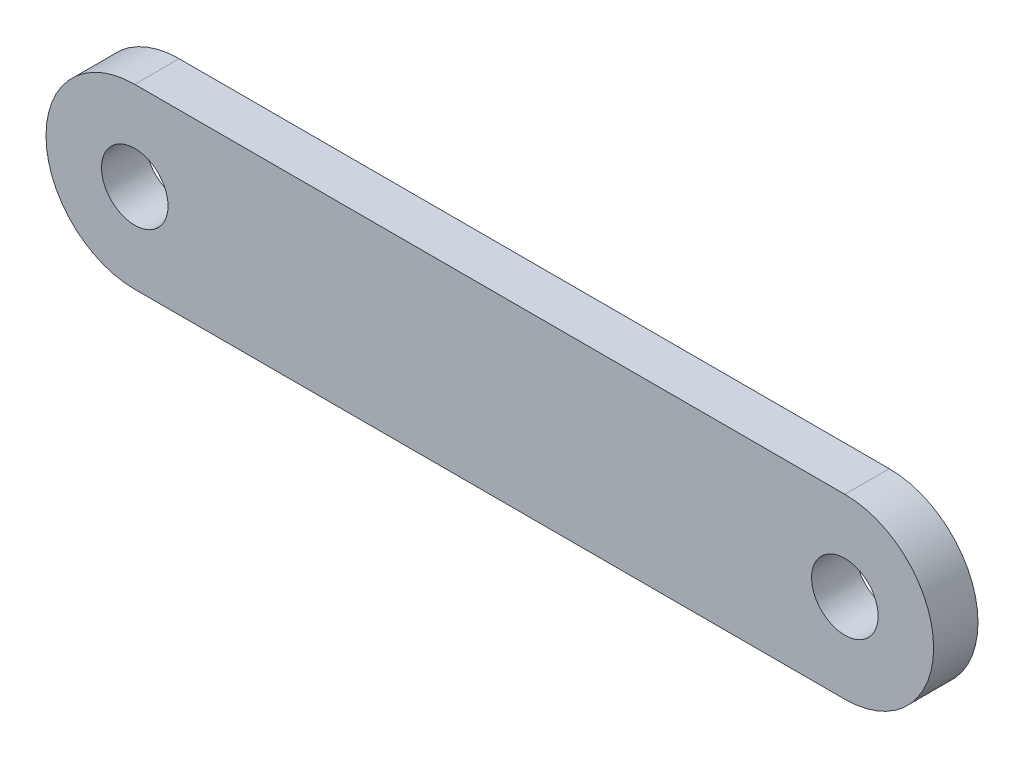
ISO-10303-21;
HEADER;
FILE_DESCRIPTION(('STEP AP214'),'2;1');
FILE_NAME('part.step','',(''),(''),'','','');
FILE_SCHEMA(('AUTOMOTIVE_DESIGN { 1 0 10303 214 1 1 1 1 }'));
ENDSEC;
DATA;
#1=APPLICATION_CONTEXT('core data for automotive mechanical design processes');
#2=APPLICATION_PROTOCOL_DEFINITION('international standard','automotive_design',2000,#1);
#3=PRODUCT_CONTEXT('',#1,'mechanical');
#4=PRODUCT('Part','Part','',(#3));
#5=PRODUCT_RELATED_PRODUCT_CATEGORY('part','',(#4));
#6=PRODUCT_DEFINITION_FORMATION('','',#4);
#7=PRODUCT_DEFINITION_CONTEXT('part definition',#1,'design');
#8=PRODUCT_DEFINITION('design','',#6,#7);
#9=PRODUCT_DEFINITION_SHAPE('','',#8);
#10=(LENGTH_UNIT() NAMED_UNIT(*) SI_UNIT(.MILLI.,.METRE.));
#11=(NAMED_UNIT(*) PLANE_ANGLE_UNIT() SI_UNIT($,.RADIAN.));
#12=(NAMED_UNIT(*) SI_UNIT($,.STERADIAN.) SOLID_ANGLE_UNIT());
#13=UNCERTAINTY_MEASURE_WITH_UNIT(LENGTH_MEASURE(1.E-05),#10,'distance_accuracy_value','');
#14=(GEOMETRIC_REPRESENTATION_CONTEXT(3) GLOBAL_UNCERTAINTY_ASSIGNED_CONTEXT((#13)) GLOBAL_UNIT_ASSIGNED_CONTEXT((#10,
#11,#12)) REPRESENTATION_CONTEXT('',''));
#15=CARTESIAN_POINT('',(0.,0.,0.));
#16=DIRECTION('',(0.,0.,1.));
#17=DIRECTION('',(1.,0.,0.));
#18=AXIS2_PLACEMENT_3D('',#15,#16,#17);
#19=CARTESIAN_POINT('',(-50.8,0.,6.35));
#20=DIRECTION('',(0.,0.,1.));
#21=DIRECTION('',(1.,0.,0.));
#22=AXIS2_PLACEMENT_3D('',#19,#20,#21);
#23=PLANE('',#22);
#24=CARTESIAN_POINT('',(50.8,0.,6.35));
#25=DIRECTION('',(0.,0.,1.));
#26=DIRECTION('',(1.,0.,0.));
#27=AXIS2_PLACEMENT_3D('',#24,#25,#26);
#28=CIRCLE('',#27,4.7625);
#29=CARTESIAN_POINT('',(55.5625,0.,6.35));
#30=VERTEX_POINT('',#29);
#31=EDGE_CURVE('E100',#30,#30,#28,.T.);
#32=ORIENTED_EDGE('',*,*,#31,.F.);
#33=EDGE_LOOP('',(#32));
#34=FACE_BOUND('',#33,.T.);
#35=CARTESIAN_POINT('',(-50.8,0.,6.35));
#36=DIRECTION('',(0.,0.,1.));
#37=DIRECTION('',(1.,0.,0.));
#38=AXIS2_PLACEMENT_3D('',#35,#36,#37);
#39=CIRCLE('',#38,12.7);
#40=CARTESIAN_POINT('',(-50.8,12.7,6.35));
#41=VERTEX_POINT('',#40);
#42=CARTESIAN_POINT('',(-50.8,-12.7,6.35));
#43=VERTEX_POINT('',#42);
#44=EDGE_CURVE('E85',#41,#43,#39,.T.);
#45=ORIENTED_EDGE('',*,*,#44,.T.);
#46=DIRECTION('',(1.,0.,0.));
#47=VECTOR('',#46,1.);
#48=CARTESIAN_POINT('',(-50.8,-12.7,6.35));
#49=LINE('',#48,#47);
#50=CARTESIAN_POINT('',(50.8,-12.7,6.35));
#51=VERTEX_POINT('',#50);
#52=EDGE_CURVE('E80',#43,#51,#49,.T.);
#53=ORIENTED_EDGE('',*,*,#52,.T.);
#54=CARTESIAN_POINT('',(50.8,0.,6.35));
#55=DIRECTION('',(0.,0.,1.));
#56=DIRECTION('',(1.,0.,0.));
#57=AXIS2_PLACEMENT_3D('',#54,#55,#56);
#58=CIRCLE('',#57,12.7);
#59=CARTESIAN_POINT('',(50.8,12.7,6.35));
#60=VERTEX_POINT('',#59);
#61=EDGE_CURVE('E83',#51,#60,#58,.T.);
#62=ORIENTED_EDGE('',*,*,#61,.T.);
#63=DIRECTION('',(-1.,0.,0.));
#64=VECTOR('',#63,1.);
#65=CARTESIAN_POINT('',(-50.8,12.7,6.35));
#66=LINE('',#65,#64);
#67=EDGE_CURVE('E50',#60,#41,#66,.T.);
#68=ORIENTED_EDGE('',*,*,#67,.T.);
#69=EDGE_LOOP('',(#45,#53,#62,#68));
#70=FACE_BOUND('',#69,.T.);
#71=CARTESIAN_POINT('',(-50.8,0.,6.35));
#72=DIRECTION('',(0.,0.,1.));
#73=DIRECTION('',(1.,0.,0.));
#74=AXIS2_PLACEMENT_3D('',#71,#72,#73);
#75=CIRCLE('',#74,4.7625);
#76=CARTESIAN_POINT('',(-46.0375,0.,6.35));
#77=VERTEX_POINT('',#76);
#78=EDGE_CURVE('E115',#77,#77,#75,.T.);
#79=ORIENTED_EDGE('',*,*,#78,.F.);
#80=EDGE_LOOP('',(#79));
#81=FACE_BOUND('',#80,.T.);
#82=ADVANCED_FACE('F33',(#34,#70,#81),#23,.T.);
#83=CARTESIAN_POINT('',(-50.8,0.,0.));
#84=DIRECTION('',(0.,0.,1.));
#85=DIRECTION('',(1.,0.,0.));
#86=AXIS2_PLACEMENT_3D('',#83,#84,#85);
#87=PLANE('',#86);
#88=CARTESIAN_POINT('',(-50.8,0.,0.));
#89=DIRECTION('',(0.,0.,1.));
#90=DIRECTION('',(1.,0.,0.));
#91=AXIS2_PLACEMENT_3D('',#88,#89,#90);
#92=CIRCLE('',#91,12.7);
#93=CARTESIAN_POINT('',(-50.8,12.7,0.));
#94=VERTEX_POINT('',#93);
#95=CARTESIAN_POINT('',(-50.8,-12.7,0.));
#96=VERTEX_POINT('',#95);
#97=EDGE_CURVE('E97',#94,#96,#92,.T.);
#98=ORIENTED_EDGE('',*,*,#97,.F.);
#99=DIRECTION('',(-1.,0.,0.));
#100=VECTOR('',#99,1.);
#101=CARTESIAN_POINT('',(-50.8,12.7,0.));
#102=LINE('',#101,#100);
#103=CARTESIAN_POINT('',(50.8,12.7,0.));
#104=VERTEX_POINT('',#103);
#105=EDGE_CURVE('E73',#104,#94,#102,.T.);
#106=ORIENTED_EDGE('',*,*,#105,.F.);
#107=CARTESIAN_POINT('',(50.8,0.,0.));
#108=DIRECTION('',(0.,0.,1.));
#109=DIRECTION('',(1.,0.,0.));
#110=AXIS2_PLACEMENT_3D('',#107,#108,#109);
#111=CIRCLE('',#110,12.7);
#112=CARTESIAN_POINT('',(50.8,-12.7,0.));
#113=VERTEX_POINT('',#112);
#114=EDGE_CURVE('E67',#113,#104,#111,.T.);
#115=ORIENTED_EDGE('',*,*,#114,.F.);
#116=DIRECTION('',(1.,0.,0.));
#117=VECTOR('',#116,1.);
#118=CARTESIAN_POINT('',(-50.8,-12.7,0.));
#119=LINE('',#118,#117);
#120=EDGE_CURVE('E89',#96,#113,#119,.T.);
#121=ORIENTED_EDGE('',*,*,#120,.F.);
#122=EDGE_LOOP('',(#98,#106,#115,#121));
#123=FACE_BOUND('',#122,.T.);
#124=CARTESIAN_POINT('',(50.8,0.,0.));
#125=DIRECTION('',(0.,0.,1.));
#126=DIRECTION('',(1.,0.,0.));
#127=AXIS2_PLACEMENT_3D('',#124,#125,#126);
#128=CIRCLE('',#127,4.7625);
#129=CARTESIAN_POINT('',(55.5625,0.,0.));
#130=VERTEX_POINT('',#129);
#131=EDGE_CURVE('E112',#130,#130,#128,.T.);
#132=ORIENTED_EDGE('',*,*,#131,.T.);
#133=EDGE_LOOP('',(#132));
#134=FACE_BOUND('',#133,.T.);
#135=CARTESIAN_POINT('',(-50.8,0.,0.));
#136=DIRECTION('',(0.,0.,1.));
#137=DIRECTION('',(1.,0.,0.));
#138=AXIS2_PLACEMENT_3D('',#135,#136,#137);
#139=CIRCLE('',#138,4.7625);
#140=CARTESIAN_POINT('',(-46.0375,0.,0.));
#141=VERTEX_POINT('',#140);
#142=EDGE_CURVE('E118',#141,#141,#139,.T.);
#143=ORIENTED_EDGE('',*,*,#142,.T.);
#144=EDGE_LOOP('',(#143));
#145=FACE_BOUND('',#144,.T.);
#146=ADVANCED_FACE('F108',(#123,#134,#145),#87,.F.);
#147=CARTESIAN_POINT('',(-50.8,0.,6.35));
#148=DIRECTION('',(0.,0.,-1.));
#149=DIRECTION('',(-1.,0.,0.));
#150=AXIS2_PLACEMENT_3D('',#147,#148,#149);
#151=CYLINDRICAL_SURFACE('',#150,12.7);
#152=ORIENTED_EDGE('',*,*,#97,.T.);
#153=DIRECTION('',(0.,0.,-1.));
#154=VECTOR('',#153,1.);
#155=CARTESIAN_POINT('',(-50.8,-12.7,6.35));
#156=LINE('',#155,#154);
#157=EDGE_CURVE('E11',#43,#96,#156,.T.);
#158=ORIENTED_EDGE('',*,*,#157,.F.);
#159=ORIENTED_EDGE('',*,*,#44,.F.);
#160=DIRECTION('',(0.,0.,-1.));
#161=VECTOR('',#160,1.);
#162=CARTESIAN_POINT('',(-50.8,12.7,6.35));
#163=LINE('',#162,#161);
#164=EDGE_CURVE('E93',#41,#94,#163,.T.);
#165=ORIENTED_EDGE('',*,*,#164,.T.);
#166=EDGE_LOOP('',(#152,#158,#159,#165));
#167=FACE_BOUND('',#166,.T.);
#168=ADVANCED_FACE('F35',(#167),#151,.T.);
#169=CARTESIAN_POINT('',(-50.8,-12.7,6.35));
#170=DIRECTION('',(0.,1.,0.));
#171=DIRECTION('',(-1.,0.,0.));
#172=AXIS2_PLACEMENT_3D('',#169,#170,#171);
#173=PLANE('',#172);
#174=ORIENTED_EDGE('',*,*,#120,.T.);
#175=DIRECTION('',(0.,0.,-1.));
#176=VECTOR('',#175,1.);
#177=CARTESIAN_POINT('',(50.8,-12.7,6.35));
#178=LINE('',#177,#176);
#179=EDGE_CURVE('E42',#51,#113,#178,.T.);
#180=ORIENTED_EDGE('',*,*,#179,.F.);
#181=ORIENTED_EDGE('',*,*,#52,.F.);
#182=ORIENTED_EDGE('',*,*,#157,.T.);
#183=EDGE_LOOP('',(#174,#180,#181,#182));
#184=FACE_BOUND('',#183,.T.);
#185=ADVANCED_FACE('F88',(#184),#173,.F.);
#186=CARTESIAN_POINT('',(50.8,0.,6.35));
#187=DIRECTION('',(0.,0.,-1.));
#188=DIRECTION('',(-1.,0.,0.));
#189=AXIS2_PLACEMENT_3D('',#186,#187,#188);
#190=CYLINDRICAL_SURFACE('',#189,12.7);
#191=ORIENTED_EDGE('',*,*,#114,.T.);
#192=DIRECTION('',(0.,0.,-1.));
#193=VECTOR('',#192,1.);
#194=CARTESIAN_POINT('',(50.8,12.7,6.35));
#195=LINE('',#194,#193);
#196=EDGE_CURVE('E90',#60,#104,#195,.T.);
#197=ORIENTED_EDGE('',*,*,#196,.F.);
#198=ORIENTED_EDGE('',*,*,#61,.F.);
#199=ORIENTED_EDGE('',*,*,#179,.T.);
#200=EDGE_LOOP('',(#191,#197,#198,#199));
#201=FACE_BOUND('',#200,.T.);
#202=ADVANCED_FACE('F91',(#201),#190,.T.);
#203=CARTESIAN_POINT('',(-50.8,12.7,6.35));
#204=DIRECTION('',(0.,-1.,0.));
#205=DIRECTION('',(1.,0.,0.));
#206=AXIS2_PLACEMENT_3D('',#203,#204,#205);
#207=PLANE('',#206);
#208=ORIENTED_EDGE('',*,*,#105,.T.);
#209=ORIENTED_EDGE('',*,*,#164,.F.);
#210=ORIENTED_EDGE('',*,*,#67,.F.);
#211=ORIENTED_EDGE('',*,*,#196,.T.);
#212=EDGE_LOOP('',(#208,#209,#210,#211));
#213=FACE_BOUND('',#212,.T.);
#214=ADVANCED_FACE('F105',(#213),#207,.F.);
#215=CARTESIAN_POINT('',(50.8,0.,6.35));
#216=DIRECTION('',(0.,0.,-1.));
#217=DIRECTION('',(-1.,0.,0.));
#218=AXIS2_PLACEMENT_3D('',#215,#216,#217);
#219=CYLINDRICAL_SURFACE('',#218,4.7625);
#220=ORIENTED_EDGE('',*,*,#31,.T.);
#221=EDGE_LOOP('',(#220));
#222=FACE_BOUND('',#221,.T.);
#223=ORIENTED_EDGE('',*,*,#131,.F.);
#224=EDGE_LOOP('',(#223));
#225=FACE_BOUND('',#224,.T.);
#226=ADVANCED_FACE('F135',(#222,#225),#219,.F.);
#227=CARTESIAN_POINT('',(-50.8,0.,6.35));
#228=DIRECTION('',(0.,0.,-1.));
#229=DIRECTION('',(-1.,0.,0.));
#230=AXIS2_PLACEMENT_3D('',#227,#228,#229);
#231=CYLINDRICAL_SURFACE('',#230,4.7625);
#232=ORIENTED_EDGE('',*,*,#78,.T.);
#233=EDGE_LOOP('',(#232));
#234=FACE_BOUND('',#233,.T.);
#235=ORIENTED_EDGE('',*,*,#142,.F.);
#236=EDGE_LOOP('',(#235));
#237=FACE_BOUND('',#236,.T.);
#238=ADVANCED_FACE('F124',(#234,#237),#231,.F.);
#239=CLOSED_SHELL('',(#82,#146,#168,#185,#202,#214,#226,#238));
#240=MANIFOLD_SOLID_BREP('B2',#239);
#241=ADVANCED_BREP_SHAPE_REPRESENTATION('',(#18,#240),#14);
#242=SHAPE_DEFINITION_REPRESENTATION(#9,#241);
ENDSEC;
END-ISO-10303-21;
